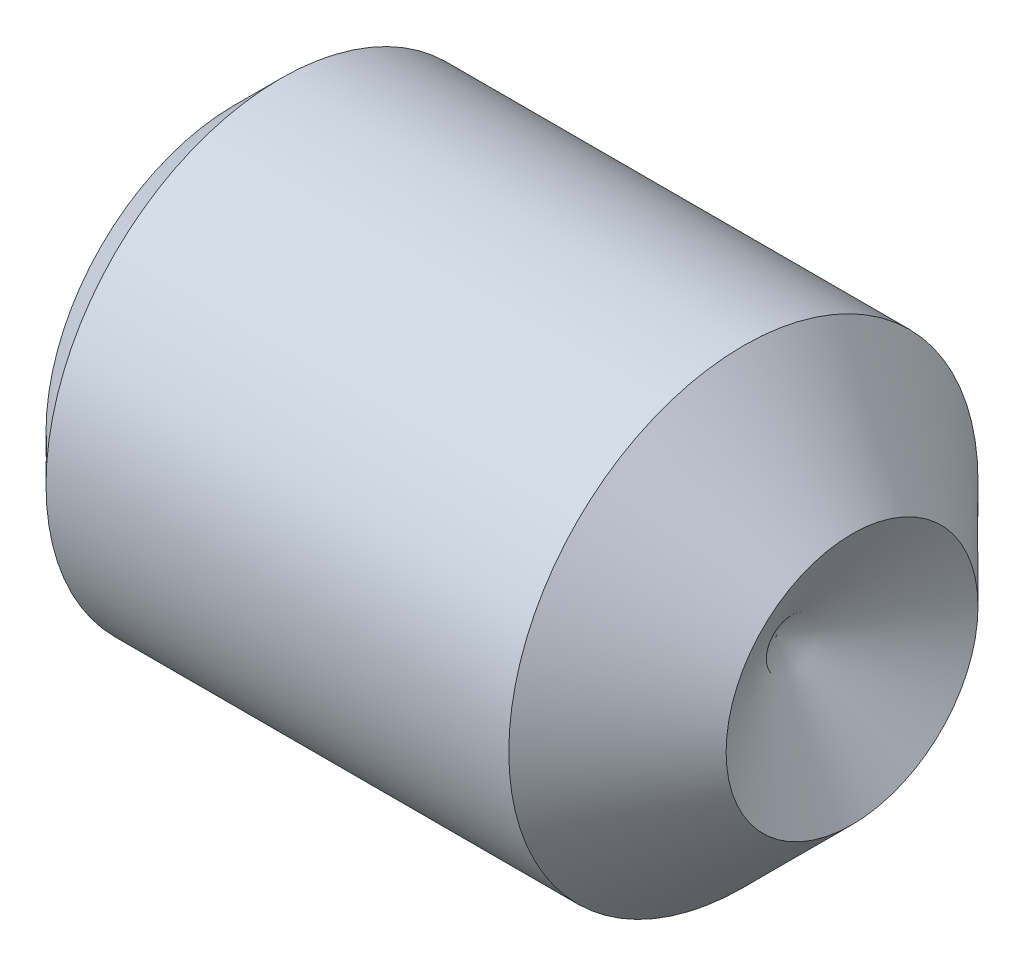
ISO-10303-21;
HEADER;
FILE_DESCRIPTION(('STEP AP214'),'2;1');
FILE_NAME('part.step','',(''),(''),'','','');
FILE_SCHEMA(('AUTOMOTIVE_DESIGN { 1 0 10303 214 1 1 1 1 }'));
ENDSEC;
DATA;
#1=APPLICATION_CONTEXT('core data for automotive mechanical design processes');
#2=APPLICATION_PROTOCOL_DEFINITION('international standard','automotive_design',2000,#1);
#3=PRODUCT_CONTEXT('',#1,'mechanical');
#4=PRODUCT('Part','Part','',(#3));
#5=PRODUCT_RELATED_PRODUCT_CATEGORY('part','',(#4));
#6=PRODUCT_DEFINITION_FORMATION('','',#4);
#7=PRODUCT_DEFINITION_CONTEXT('part definition',#1,'design');
#8=PRODUCT_DEFINITION('design','',#6,#7);
#9=PRODUCT_DEFINITION_SHAPE('','',#8);
#10=(LENGTH_UNIT() NAMED_UNIT(*) SI_UNIT(.MILLI.,.METRE.));
#11=(NAMED_UNIT(*) PLANE_ANGLE_UNIT() SI_UNIT($,.RADIAN.));
#12=(NAMED_UNIT(*) SI_UNIT($,.STERADIAN.) SOLID_ANGLE_UNIT());
#13=UNCERTAINTY_MEASURE_WITH_UNIT(LENGTH_MEASURE(1.E-05),#10,'distance_accuracy_value','');
#14=(GEOMETRIC_REPRESENTATION_CONTEXT(3) GLOBAL_UNCERTAINTY_ASSIGNED_CONTEXT((#13)) GLOBAL_UNIT_ASSIGNED_CONTEXT((#10,
#11,#12)) REPRESENTATION_CONTEXT('',''));
#15=CARTESIAN_POINT('',(0.,0.,0.));
#16=DIRECTION('',(0.,0.,1.));
#17=DIRECTION('',(1.,0.,0.));
#18=AXIS2_PLACEMENT_3D('',#15,#16,#17);
#19=CARTESIAN_POINT('',(2.54,1.18999000000001,0.687041046832967));
#20=DIRECTION('',(0.,1.,0.));
#21=DIRECTION('',(0.,0.,1.));
#22=AXIS2_PLACEMENT_3D('',#19,#20,#21);
#23=PLANE('',#22);
#24=DIRECTION('',(0.,0.,1.));
#25=VECTOR('',#24,1.);
#26=CARTESIAN_POINT('',(2.54,1.18999000000001,0.687041046832967));
#27=LINE('',#26,#25);
#28=CARTESIAN_POINT('',(2.54,1.18999000000001,0.687041046832967));
#29=VERTEX_POINT('',#28);
#30=CARTESIAN_POINT('',(2.54,1.18999000000001,-0.687041046832961));
#31=VERTEX_POINT('',#30);
#32=EDGE_CURVE('E79',#29,#31,#27,.F.);
#33=ORIENTED_EDGE('',*,*,#32,.F.);
#34=DIRECTION('',(1.,0.,0.));
#35=VECTOR('',#34,1.);
#36=CARTESIAN_POINT('',(2.54,1.18999000000001,0.687041046832967));
#37=LINE('',#36,#35);
#38=CARTESIAN_POINT('',(0.,1.18999000000001,0.687041046832968));
#39=VERTEX_POINT('',#38);
#40=EDGE_CURVE('E85',#39,#29,#37,.T.);
#41=ORIENTED_EDGE('',*,*,#40,.F.);
#42=DIRECTION('',(0.,0.,1.));
#43=VECTOR('',#42,1.);
#44=CARTESIAN_POINT('',(0.,1.18999000000001,0.687041046832967));
#45=LINE('',#44,#43);
#46=CARTESIAN_POINT('',(0.,1.18999000000001,-0.687041046832962));
#47=VERTEX_POINT('',#46);
#48=EDGE_CURVE('E68',#47,#39,#45,.T.);
#49=ORIENTED_EDGE('',*,*,#48,.F.);
#50=DIRECTION('',(1.,0.,0.));
#51=VECTOR('',#50,1.);
#52=CARTESIAN_POINT('',(2.54,1.18999000000001,-0.687041046832962));
#53=LINE('',#52,#51);
#54=EDGE_CURVE('E78',#47,#31,#53,.T.);
#55=ORIENTED_EDGE('',*,*,#54,.T.);
#56=EDGE_LOOP('',(#33,#41,#49,#55));
#57=FACE_BOUND('',#56,.T.);
#58=ADVANCED_FACE('F16',(#57),#23,.F.);
#59=CARTESIAN_POINT('',(2.54,1.18999000000001,-0.687041046832962));
#60=DIRECTION('',(0.,0.5,-0.866025403784439));
#61=DIRECTION('',(0.,0.866025403784439,0.5));
#62=AXIS2_PLACEMENT_3D('',#59,#60,#61);
#63=PLANE('',#62);
#64=DIRECTION('',(0.,0.866025403784438,0.5));
#65=VECTOR('',#64,1.);
#66=CARTESIAN_POINT('',(2.54,0.,-1.37408209366593));
#67=LINE('',#66,#65);
#68=CARTESIAN_POINT('',(2.54,0.,-1.37408209366593));
#69=VERTEX_POINT('',#68);
#70=EDGE_CURVE('E88',#69,#31,#67,.T.);
#71=ORIENTED_EDGE('',*,*,#70,.T.);
#72=ORIENTED_EDGE('',*,*,#54,.F.);
#73=DIRECTION('',(0.,0.866025403784439,0.5));
#74=VECTOR('',#73,1.);
#75=CARTESIAN_POINT('',(0.,1.18999000000001,-0.687041046832962));
#76=LINE('',#75,#74);
#77=CARTESIAN_POINT('',(0.,0.,-1.37408209366593));
#78=VERTEX_POINT('',#77);
#79=EDGE_CURVE('E71',#78,#47,#76,.T.);
#80=ORIENTED_EDGE('',*,*,#79,.F.);
#81=DIRECTION('',(1.,0.,0.));
#82=VECTOR('',#81,1.);
#83=CARTESIAN_POINT('',(2.54,0.,-1.37408209366593));
#84=LINE('',#83,#82);
#85=EDGE_CURVE('E108',#69,#78,#84,.F.);
#86=ORIENTED_EDGE('',*,*,#85,.F.);
#87=EDGE_LOOP('',(#71,#72,#80,#86));
#88=FACE_BOUND('',#87,.T.);
#89=ADVANCED_FACE('F87',(#88),#63,.F.);
#90=CARTESIAN_POINT('',(2.54,1.18999000000001,0.687041046832967));
#91=DIRECTION('',(0.,-0.499999999999998,-0.86602540378444));
#92=DIRECTION('',(0.,0.86602540378444,-0.499999999999998));
#93=AXIS2_PLACEMENT_3D('',#90,#91,#92);
#94=PLANE('',#93);
#95=DIRECTION('',(0.,0.86602540378444,-0.499999999999998));
#96=VECTOR('',#95,1.);
#97=CARTESIAN_POINT('',(0.,1.18999000000001,0.687041046832967));
#98=LINE('',#97,#96);
#99=CARTESIAN_POINT('',(0.,0.,1.37408209366593));
#100=VERTEX_POINT('',#99);
#101=EDGE_CURVE('E89',#100,#39,#98,.T.);
#102=ORIENTED_EDGE('',*,*,#101,.T.);
#103=ORIENTED_EDGE('',*,*,#40,.T.);
#104=DIRECTION('',(0.,-0.86602540378444,0.499999999999998));
#105=VECTOR('',#104,1.);
#106=CARTESIAN_POINT('',(2.54,1.18999000000001,0.687041046832967));
#107=LINE('',#106,#105);
#108=CARTESIAN_POINT('',(2.54,0.,1.37408209366593));
#109=VERTEX_POINT('',#108);
#110=EDGE_CURVE('E98',#29,#109,#107,.T.);
#111=ORIENTED_EDGE('',*,*,#110,.T.);
#112=DIRECTION('',(1.,0.,0.));
#113=VECTOR('',#112,1.);
#114=CARTESIAN_POINT('',(2.54,0.,1.37408209366593));
#115=LINE('',#114,#113);
#116=EDGE_CURVE('E114',#109,#100,#115,.F.);
#117=ORIENTED_EDGE('',*,*,#116,.T.);
#118=EDGE_LOOP('',(#102,#103,#111,#117));
#119=FACE_BOUND('',#118,.T.);
#120=ADVANCED_FACE('F100',(#119),#94,.T.);
#121=CARTESIAN_POINT('',(2.54,1.18999000000001,0.687041046832967));
#122=DIRECTION('',(1.,0.,0.));
#123=DIRECTION('',(0.,0.,-1.));
#124=AXIS2_PLACEMENT_3D('',#121,#122,#123);
#125=PLANE('',#124);
#126=ORIENTED_EDGE('',*,*,#70,.F.);
#127=DIRECTION('',(0.,-0.86602540378444,0.499999999999998));
#128=VECTOR('',#127,1.);
#129=CARTESIAN_POINT('',(2.54,-1.18999,-0.687041046832964));
#130=LINE('',#129,#128);
#131=CARTESIAN_POINT('',(2.54,-1.18999,-0.687041046832964));
#132=VERTEX_POINT('',#131);
#133=EDGE_CURVE('E105',#132,#69,#130,.F.);
#134=ORIENTED_EDGE('',*,*,#133,.F.);
#135=DIRECTION('',(0.,0.,1.));
#136=VECTOR('',#135,1.);
#137=CARTESIAN_POINT('',(2.54,-1.18999,0.687041046832965));
#138=LINE('',#137,#136);
#139=CARTESIAN_POINT('',(2.54,-1.18999,0.687041046832965));
#140=VERTEX_POINT('',#139);
#141=EDGE_CURVE('E116',#140,#132,#138,.F.);
#142=ORIENTED_EDGE('',*,*,#141,.F.);
#143=DIRECTION('',(0.,-0.866025403784439,-0.5));
#144=VECTOR('',#143,1.);
#145=CARTESIAN_POINT('',(2.54,-1.18999,0.687041046832965));
#146=LINE('',#145,#144);
#147=EDGE_CURVE('E112',#140,#109,#146,.F.);
#148=ORIENTED_EDGE('',*,*,#147,.T.);
#149=ORIENTED_EDGE('',*,*,#110,.F.);
#150=ORIENTED_EDGE('',*,*,#32,.T.);
#151=EDGE_LOOP('',(#126,#134,#142,#148,#149,#150));
#152=FACE_BOUND('',#151,.T.);
#153=ADVANCED_FACE('F96',(#152),#125,.F.);
#154=CARTESIAN_POINT('',(2.54,-1.18999,-0.687041046832964));
#155=DIRECTION('',(0.,0.499999999999998,0.86602540378444));
#156=DIRECTION('',(0.,-0.86602540378444,0.499999999999998));
#157=AXIS2_PLACEMENT_3D('',#154,#155,#156);
#158=PLANE('',#157);
#159=DIRECTION('',(0.,-0.86602540378444,0.499999999999998));
#160=VECTOR('',#159,1.);
#161=CARTESIAN_POINT('',(0.,-1.18999,-0.687041046832964));
#162=LINE('',#161,#160);
#163=CARTESIAN_POINT('',(0.,-1.18999,-0.687041046832964));
#164=VERTEX_POINT('',#163);
#165=EDGE_CURVE('E73',#78,#164,#162,.T.);
#166=ORIENTED_EDGE('',*,*,#165,.T.);
#167=DIRECTION('',(1.,0.,0.));
#168=VECTOR('',#167,1.);
#169=CARTESIAN_POINT('',(2.54,-1.18999,-0.687041046832964));
#170=LINE('',#169,#168);
#171=EDGE_CURVE('E119',#132,#164,#170,.F.);
#172=ORIENTED_EDGE('',*,*,#171,.F.);
#173=ORIENTED_EDGE('',*,*,#133,.T.);
#174=ORIENTED_EDGE('',*,*,#85,.T.);
#175=EDGE_LOOP('',(#166,#172,#173,#174));
#176=FACE_BOUND('',#175,.T.);
#177=ADVANCED_FACE('F202',(#176),#158,.T.);
#178=CARTESIAN_POINT('',(2.54,-1.18999,0.687041046832965));
#179=DIRECTION('',(0.,-0.5,0.866025403784439));
#180=DIRECTION('',(0.,-0.866025403784439,-0.5));
#181=AXIS2_PLACEMENT_3D('',#178,#179,#180);
#182=PLANE('',#181);
#183=ORIENTED_EDGE('',*,*,#147,.F.);
#184=DIRECTION('',(1.,0.,0.));
#185=VECTOR('',#184,1.);
#186=CARTESIAN_POINT('',(2.54,-1.18999,0.687041046832965));
#187=LINE('',#186,#185);
#188=CARTESIAN_POINT('',(0.,-1.18999,0.687041046832965));
#189=VERTEX_POINT('',#188);
#190=EDGE_CURVE('E122',#189,#140,#187,.T.);
#191=ORIENTED_EDGE('',*,*,#190,.F.);
#192=DIRECTION('',(0.,-0.866025403784439,-0.5));
#193=VECTOR('',#192,1.);
#194=CARTESIAN_POINT('',(0.,-1.18999,0.687041046832965));
#195=LINE('',#194,#193);
#196=EDGE_CURVE('E34',#100,#189,#195,.T.);
#197=ORIENTED_EDGE('',*,*,#196,.F.);
#198=ORIENTED_EDGE('',*,*,#116,.F.);
#199=EDGE_LOOP('',(#183,#191,#197,#198));
#200=FACE_BOUND('',#199,.T.);
#201=ADVANCED_FACE('F192',(#200),#182,.F.);
#202=CARTESIAN_POINT('',(2.54,-1.18999,0.687041046832965));
#203=DIRECTION('',(0.,1.,0.));
#204=DIRECTION('',(0.,0.,1.));
#205=AXIS2_PLACEMENT_3D('',#202,#203,#204);
#206=PLANE('',#205);
#207=DIRECTION('',(0.,0.,1.));
#208=VECTOR('',#207,1.);
#209=CARTESIAN_POINT('',(0.,-1.18999,0.));
#210=LINE('',#209,#208);
#211=EDGE_CURVE('E125',#189,#164,#210,.F.);
#212=ORIENTED_EDGE('',*,*,#211,.F.);
#213=ORIENTED_EDGE('',*,*,#190,.T.);
#214=ORIENTED_EDGE('',*,*,#141,.T.);
#215=ORIENTED_EDGE('',*,*,#171,.T.);
#216=EDGE_LOOP('',(#212,#213,#214,#215));
#217=FACE_BOUND('',#216,.T.);
#218=ADVANCED_FACE('F149',(#217),#206,.T.);
#219=CARTESIAN_POINT('',(6.34999999999764,0.,0.));
#220=DIRECTION('',(1.,0.,0.));
#221=DIRECTION('',(0.,0.,-1.));
#222=AXIS2_PLACEMENT_3D('',#219,#220,#221);
#223=CONICAL_SURFACE('',#222,1.29540000000361,1.02974425858884);
#224=CARTESIAN_POINT('',(5.57164515407749,0.,0.));
#225=VERTEX_POINT('',#224);
#226=VERTEX_LOOP('',#225);
#227=FACE_BOUND('',#226,.T.);
#228=CARTESIAN_POINT('',(6.34999999994079,0.,0.));
#229=DIRECTION('',(-1.,0.,0.));
#230=DIRECTION('',(0.,0.,1.));
#231=AXIS2_PLACEMENT_3D('',#228,#229,#230);
#232=CIRCLE('',#231,1.29540000000361);
#233=CARTESIAN_POINT('',(6.34999999994079,0.,1.29540000000361));
#234=VERTEX_POINT('',#233);
#235=EDGE_CURVE('E127',#234,#234,#232,.T.);
#236=ORIENTED_EDGE('',*,*,#235,.F.);
#237=EDGE_LOOP('',(#236));
#238=FACE_BOUND('',#237,.T.);
#239=ADVANCED_FACE('F140',(#227,#238),#223,.F.);
#240=CARTESIAN_POINT('',(0.,0.,0.));
#241=DIRECTION('',(-1.,0.,0.));
#242=DIRECTION('',(0.,0.,1.));
#243=AXIS2_PLACEMENT_3D('',#240,#241,#242);
#244=PLANE('',#243);
#245=CARTESIAN_POINT('',(0.,0.,0.));
#246=DIRECTION('',(1.,0.,0.));
#247=DIRECTION('',(0.,0.,-1.));
#248=AXIS2_PLACEMENT_3D('',#245,#246,#247);
#249=CIRCLE('',#248,1.94055999992315);
#250=CARTESIAN_POINT('',(0.,0.,-1.94055999992315));
#251=VERTEX_POINT('',#250);
#252=EDGE_CURVE('E19',#251,#251,#249,.T.);
#253=ORIENTED_EDGE('',*,*,#252,.F.);
#254=EDGE_LOOP('',(#253));
#255=FACE_BOUND('',#254,.T.);
#256=ORIENTED_EDGE('',*,*,#196,.T.);
#257=ORIENTED_EDGE('',*,*,#211,.T.);
#258=ORIENTED_EDGE('',*,*,#165,.F.);
#259=ORIENTED_EDGE('',*,*,#79,.T.);
#260=ORIENTED_EDGE('',*,*,#48,.T.);
#261=ORIENTED_EDGE('',*,*,#101,.F.);
#262=EDGE_LOOP('',(#256,#257,#258,#259,#260,#261));
#263=FACE_BOUND('',#262,.T.);
#264=ADVANCED_FACE('F72',(#255,#263),#244,.T.);
#265=CARTESIAN_POINT('',(5.23240000012493,0.,0.));
#266=DIRECTION('',(-1.,0.,0.));
#267=DIRECTION('',(0.,0.,1.));
#268=AXIS2_PLACEMENT_3D('',#265,#266,#267);
#269=CONICAL_SURFACE('',#268,2.41299999981948,0.785398163397448);
#270=CARTESIAN_POINT('',(5.23240000000002,0.,0.));
#271=DIRECTION('',(-1.,0.,0.));
#272=DIRECTION('',(0.,0.,1.));
#273=AXIS2_PLACEMENT_3D('',#270,#271,#272);
#274=CIRCLE('',#273,2.413);
#275=CARTESIAN_POINT('',(5.23240000000002,0.,2.413));
#276=VERTEX_POINT('',#275);
#277=EDGE_CURVE('E25',#276,#276,#274,.T.);
#278=ORIENTED_EDGE('',*,*,#277,.F.);
#279=EDGE_LOOP('',(#278));
#280=FACE_BOUND('',#279,.T.);
#281=ORIENTED_EDGE('',*,*,#235,.T.);
#282=EDGE_LOOP('',(#281));
#283=FACE_BOUND('',#282,.T.);
#284=ADVANCED_FACE('F139',(#280,#283),#269,.T.);
#285=CARTESIAN_POINT('',(0.472440000066854,0.,0.));
#286=DIRECTION('',(1.,0.,0.));
#287=DIRECTION('',(0.,0.,-1.));
#288=AXIS2_PLACEMENT_3D('',#285,#286,#287);
#289=CONICAL_SURFACE('',#288,2.41299999999001,0.785398163397448);
#290=CARTESIAN_POINT('',(0.472440000000003,0.,0.));
#291=DIRECTION('',(-1.,0.,0.));
#292=DIRECTION('',(0.,0.,1.));
#293=AXIS2_PLACEMENT_3D('',#290,#291,#292);
#294=CIRCLE('',#293,2.413);
#295=CARTESIAN_POINT('',(0.472440000000003,0.,2.413));
#296=VERTEX_POINT('',#295);
#297=EDGE_CURVE('E11',#296,#296,#294,.F.);
#298=ORIENTED_EDGE('',*,*,#297,.F.);
#299=EDGE_LOOP('',(#298));
#300=FACE_BOUND('',#299,.T.);
#301=ORIENTED_EDGE('',*,*,#252,.T.);
#302=EDGE_LOOP('',(#301));
#303=FACE_BOUND('',#302,.T.);
#304=ADVANCED_FACE('F136',(#300,#303),#289,.T.);
#305=CARTESIAN_POINT('',(-12.7,0.,0.));
#306=DIRECTION('',(-1.,0.,0.));
#307=DIRECTION('',(0.,0.,1.));
#308=AXIS2_PLACEMENT_3D('',#305,#306,#307);
#309=CYLINDRICAL_SURFACE('',#308,2.413);
#310=ORIENTED_EDGE('',*,*,#297,.T.);
#311=EDGE_LOOP('',(#310));
#312=FACE_BOUND('',#311,.T.);
#313=ORIENTED_EDGE('',*,*,#277,.T.);
#314=EDGE_LOOP('',(#313));
#315=FACE_BOUND('',#314,.T.);
#316=ADVANCED_FACE('F152',(#312,#315),#309,.T.);
#317=CLOSED_SHELL('',(#58,#89,#120,#153,#177,#201,#218,#239,#264,#284,#304,#316));
#318=MANIFOLD_SOLID_BREP('B1',#317);
#319=ADVANCED_BREP_SHAPE_REPRESENTATION('',(#18,#318),#14);
#320=SHAPE_DEFINITION_REPRESENTATION(#9,#319);
ENDSEC;
END-ISO-10303-21;
